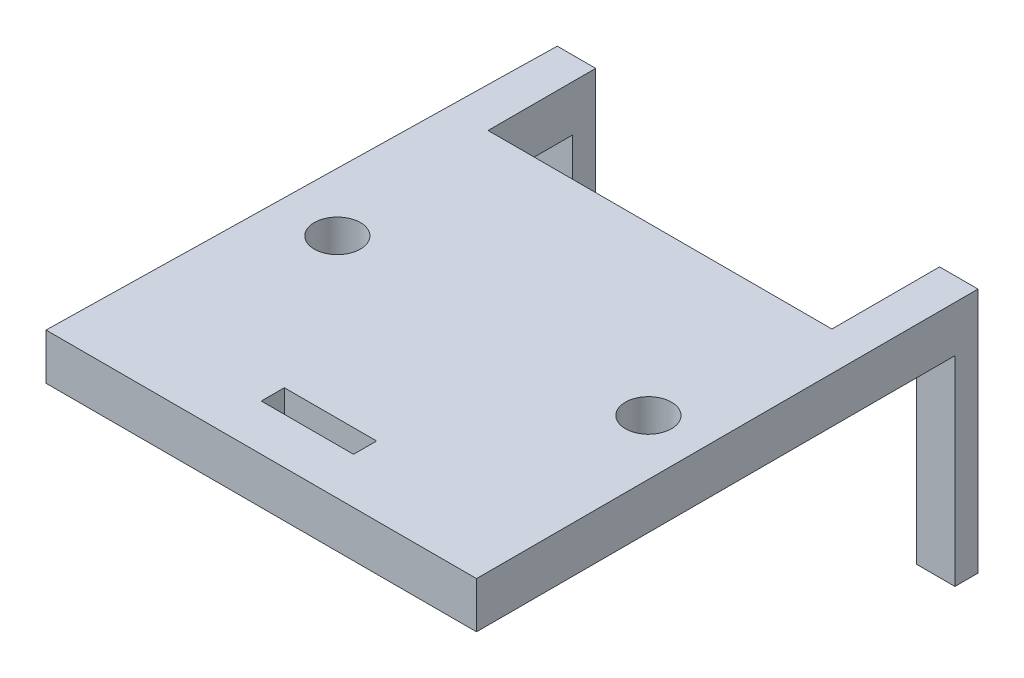
ISO-10303-21;
HEADER;
FILE_DESCRIPTION(('STEP AP214'),'2;1');
FILE_NAME('part.step','',(''),(''),'','','');
FILE_SCHEMA(('AUTOMOTIVE_DESIGN { 1 0 10303 214 1 1 1 1 }'));
ENDSEC;
DATA;
#1=APPLICATION_CONTEXT('core data for automotive mechanical design processes');
#2=APPLICATION_PROTOCOL_DEFINITION('international standard','automotive_design',2000,#1);
#3=PRODUCT_CONTEXT('',#1,'mechanical');
#4=PRODUCT('Part','Part','',(#3));
#5=PRODUCT_RELATED_PRODUCT_CATEGORY('part','',(#4));
#6=PRODUCT_DEFINITION_FORMATION('','',#4);
#7=PRODUCT_DEFINITION_CONTEXT('part definition',#1,'design');
#8=PRODUCT_DEFINITION('design','',#6,#7);
#9=PRODUCT_DEFINITION_SHAPE('','',#8);
#10=(LENGTH_UNIT() NAMED_UNIT(*) SI_UNIT(.MILLI.,.METRE.));
#11=(NAMED_UNIT(*) PLANE_ANGLE_UNIT() SI_UNIT($,.RADIAN.));
#12=(NAMED_UNIT(*) SI_UNIT($,.STERADIAN.) SOLID_ANGLE_UNIT());
#13=UNCERTAINTY_MEASURE_WITH_UNIT(LENGTH_MEASURE(1.E-05),#10,'distance_accuracy_value','');
#14=(GEOMETRIC_REPRESENTATION_CONTEXT(3) GLOBAL_UNCERTAINTY_ASSIGNED_CONTEXT((#13)) GLOBAL_UNIT_ASSIGNED_CONTEXT((#10,
#11,#12)) REPRESENTATION_CONTEXT('',''));
#15=CARTESIAN_POINT('',(0.,0.,0.));
#16=DIRECTION('',(0.,0.,1.));
#17=DIRECTION('',(1.,0.,0.));
#18=AXIS2_PLACEMENT_3D('',#15,#16,#17);
#19=CARTESIAN_POINT('',(0.,0.,0.));
#20=DIRECTION('',(0.,-1.,0.));
#21=DIRECTION('',(0.,0.,-1.));
#22=AXIS2_PLACEMENT_3D('',#19,#20,#21);
#23=PLANE('',#22);
#24=DIRECTION('',(0.,0.,-1.));
#25=VECTOR('',#24,1.);
#26=CARTESIAN_POINT('',(10.4999995670526,0.,0.));
#27=LINE('',#26,#25);
#28=CARTESIAN_POINT('',(10.4999995670526,0.,22.6135928485787));
#29=VERTEX_POINT('',#28);
#30=CARTESIAN_POINT('',(10.4999995670526,0.,21.1135928485787));
#31=VERTEX_POINT('',#30);
#32=EDGE_CURVE('E196',#29,#31,#27,.T.);
#33=ORIENTED_EDGE('',*,*,#32,.F.);
#34=DIRECTION('',(-1.,0.,0.));
#35=VECTOR('',#34,1.);
#36=CARTESIAN_POINT('',(0.,0.,22.6135928485787));
#37=LINE('',#36,#35);
#38=CARTESIAN_POINT('',(16.4999995670526,0.,22.6135928485787));
#39=VERTEX_POINT('',#38);
#40=EDGE_CURVE('E184',#39,#29,#37,.T.);
#41=ORIENTED_EDGE('',*,*,#40,.F.);
#42=DIRECTION('',(0.,0.,1.));
#43=VECTOR('',#42,1.);
#44=CARTESIAN_POINT('',(16.4999995670527,0.,0.));
#45=LINE('',#44,#43);
#46=CARTESIAN_POINT('',(16.4999995670526,0.,21.1135928485787));
#47=VERTEX_POINT('',#46);
#48=EDGE_CURVE('E159',#47,#39,#45,.T.);
#49=ORIENTED_EDGE('',*,*,#48,.F.);
#50=DIRECTION('',(1.,0.,0.));
#51=VECTOR('',#50,1.);
#52=CARTESIAN_POINT('',(0.,0.,21.1135928485787));
#53=LINE('',#52,#51);
#54=EDGE_CURVE('E193',#31,#47,#53,.T.);
#55=ORIENTED_EDGE('',*,*,#54,.F.);
#56=EDGE_LOOP('',(#33,#41,#49,#55));
#57=FACE_BOUND('',#56,.T.);
#58=CARTESIAN_POINT('',(3.66912853310911,0.,10.8361451033341));
#59=DIRECTION('',(0.,-1.,0.));
#60=DIRECTION('',(0.,0.,-1.));
#61=AXIS2_PLACEMENT_3D('',#58,#59,#60);
#62=CIRCLE('',#61,1.5);
#63=CARTESIAN_POINT('',(3.66912853310911,0.,9.33614510333406));
#64=VERTEX_POINT('',#63);
#65=EDGE_CURVE('E211',#64,#64,#62,.T.);
#66=ORIENTED_EDGE('',*,*,#65,.F.);
#67=EDGE_LOOP('',(#66));
#68=FACE_BOUND('',#67,.T.);
#69=CARTESIAN_POINT('',(23.9026242675036,0.,10.8361451033341));
#70=DIRECTION('',(0.,-1.,0.));
#71=DIRECTION('',(0.,0.,-1.));
#72=AXIS2_PLACEMENT_3D('',#69,#70,#71);
#73=CIRCLE('',#72,1.5);
#74=CARTESIAN_POINT('',(23.9026242675036,0.,9.33614510333406));
#75=VERTEX_POINT('',#74);
#76=EDGE_CURVE('E204',#75,#75,#73,.T.);
#77=ORIENTED_EDGE('',*,*,#76,.F.);
#78=EDGE_LOOP('',(#77));
#79=FACE_BOUND('',#78,.T.);
#80=DIRECTION('',(0.,0.,1.));
#81=VECTOR('',#80,1.);
#82=CARTESIAN_POINT('',(24.9999995670526,0.,-6.99866665142131));
#83=LINE('',#82,#81);
#84=CARTESIAN_POINT('',(24.9999995670526,0.,-5.49866665142131));
#85=VERTEX_POINT('',#84);
#86=CARTESIAN_POINT('',(24.9999995670526,0.,0.00133334857869202));
#87=VERTEX_POINT('',#86);
#88=EDGE_CURVE('E304',#85,#87,#83,.T.);
#89=ORIENTED_EDGE('',*,*,#88,.F.);
#90=DIRECTION('',(-1.,0.,0.));
#91=VECTOR('',#90,1.);
#92=CARTESIAN_POINT('',(24.9999995670526,0.,-5.49866665142131));
#93=LINE('',#92,#91);
#94=CARTESIAN_POINT('',(27.4999995670526,0.,-5.49866665142131));
#95=VERTEX_POINT('',#94);
#96=EDGE_CURVE('E215',#95,#85,#93,.T.);
#97=ORIENTED_EDGE('',*,*,#96,.F.);
#98=DIRECTION('',(0.,0.,-1.));
#99=VECTOR('',#98,1.);
#100=CARTESIAN_POINT('',(27.4999995670526,0.,-6.99866665142131));
#101=LINE('',#100,#99);
#102=CARTESIAN_POINT('',(27.4999995670526,0.,25.6135928485787));
#103=VERTEX_POINT('',#102);
#104=EDGE_CURVE('E300',#103,#95,#101,.T.);
#105=ORIENTED_EDGE('',*,*,#104,.F.);
#106=DIRECTION('',(1.,0.,0.));
#107=VECTOR('',#106,1.);
#108=CARTESIAN_POINT('',(27.4999995670526,0.,25.6135928485787));
#109=LINE('',#108,#107);
#110=CARTESIAN_POINT('',(-0.500000432947365,0.,25.6135928485787));
#111=VERTEX_POINT('',#110);
#112=EDGE_CURVE('E296',#111,#103,#109,.T.);
#113=ORIENTED_EDGE('',*,*,#112,.F.);
#114=DIRECTION('',(-0.0195171835765495,0.,0.999809521631615));
#115=VECTOR('',#114,1.);
#116=CARTESIAN_POINT('',(-0.500000432947365,0.,25.6135928485787));
#117=LINE('',#116,#115);
#118=CARTESIAN_POINT('',(0.107338932206711,0.,-5.49866665142131));
#119=VERTEX_POINT('',#118);
#120=EDGE_CURVE('E267',#119,#111,#117,.T.);
#121=ORIENTED_EDGE('',*,*,#120,.F.);
#122=DIRECTION('',(-1.,0.,0.));
#123=VECTOR('',#122,1.);
#124=CARTESIAN_POINT('',(0.107338932206711,0.,-5.49866665142131));
#125=LINE('',#124,#123);
#126=CARTESIAN_POINT('',(2.63662028503585,0.,-5.49866665142131));
#127=VERTEX_POINT('',#126);
#128=EDGE_CURVE('E240',#127,#119,#125,.T.);
#129=ORIENTED_EDGE('',*,*,#128,.F.);
#130=DIRECTION('',(0.,0.,-1.));
#131=VECTOR('',#130,1.);
#132=CARTESIAN_POINT('',(2.63662028503585,0.,-6.99866665142131));
#133=LINE('',#132,#131);
#134=CARTESIAN_POINT('',(2.63662028503585,0.,0.00133334857869202));
#135=VERTEX_POINT('',#134);
#136=EDGE_CURVE('E272',#135,#127,#133,.T.);
#137=ORIENTED_EDGE('',*,*,#136,.F.);
#138=DIRECTION('',(-1.,0.,0.));
#139=VECTOR('',#138,1.);
#140=CARTESIAN_POINT('',(2.63662028503585,0.,0.00133334857869202));
#141=LINE('',#140,#139);
#142=EDGE_CURVE('E307',#87,#135,#141,.T.);
#143=ORIENTED_EDGE('',*,*,#142,.F.);
#144=EDGE_LOOP('',(#89,#97,#105,#113,#121,#129,#137,#143));
#145=FACE_BOUND('',#144,.T.);
#146=ADVANCED_FACE('F39',(#57,#68,#79,#145),#23,.T.);
#147=CARTESIAN_POINT('',(-0.500000432947365,3.,25.6135928485787));
#148=DIRECTION('',(0.999809521631615,0.,0.0195171835765495));
#149=DIRECTION('',(0.0195171835765495,0.,-0.999809521631615));
#150=AXIS2_PLACEMENT_3D('',#147,#148,#149);
#151=PLANE('',#150);
#152=DIRECTION('',(0.,-1.,0.));
#153=VECTOR('',#152,1.);
#154=CARTESIAN_POINT('',(0.136620285035847,3.,-6.99866665142131));
#155=LINE('',#154,#153);
#156=CARTESIAN_POINT('',(0.136620285035847,3.,-6.99866665142131));
#157=VERTEX_POINT('',#156);
#158=CARTESIAN_POINT('',(0.136620285035847,-13.,-6.99866665142131));
#159=VERTEX_POINT('',#158);
#160=EDGE_CURVE('E293',#157,#159,#155,.T.);
#161=ORIENTED_EDGE('',*,*,#160,.T.);
#162=DIRECTION('',(0.0195171835765495,0.,-0.999809521631615));
#163=VECTOR('',#162,1.);
#164=CARTESIAN_POINT('',(0.136620285035847,-13.,-6.99866665142131));
#165=LINE('',#164,#163);
#166=CARTESIAN_POINT('',(0.107338932206711,-13.,-5.49866665142131));
#167=VERTEX_POINT('',#166);
#168=EDGE_CURVE('E248',#167,#159,#165,.T.);
#169=ORIENTED_EDGE('',*,*,#168,.F.);
#170=DIRECTION('',(0.,1.,0.));
#171=VECTOR('',#170,1.);
#172=CARTESIAN_POINT('',(0.107338932206711,-13.,-5.49866665142131));
#173=LINE('',#172,#171);
#174=EDGE_CURVE('E256',#167,#119,#173,.T.);
#175=ORIENTED_EDGE('',*,*,#174,.T.);
#176=ORIENTED_EDGE('',*,*,#120,.T.);
#177=DIRECTION('',(0.,-1.,0.));
#178=VECTOR('',#177,1.);
#179=CARTESIAN_POINT('',(-0.500000432947365,3.,25.6135928485787));
#180=LINE('',#179,#178);
#181=CARTESIAN_POINT('',(-0.500000432947365,3.,25.6135928485787));
#182=VERTEX_POINT('',#181);
#183=EDGE_CURVE('E11',#182,#111,#180,.T.);
#184=ORIENTED_EDGE('',*,*,#183,.F.);
#185=DIRECTION('',(-0.0195171835765495,0.,0.999809521631615));
#186=VECTOR('',#185,1.);
#187=CARTESIAN_POINT('',(0.,3.,0.));
#188=LINE('',#187,#186);
#189=EDGE_CURVE('E268',#157,#182,#188,.T.);
#190=ORIENTED_EDGE('',*,*,#189,.F.);
#191=EDGE_LOOP('',(#161,#169,#175,#176,#184,#190));
#192=FACE_BOUND('',#191,.T.);
#193=ADVANCED_FACE('F41',(#192),#151,.F.);
#194=CARTESIAN_POINT('',(27.4999995670526,3.,25.6135928485787));
#195=DIRECTION('',(0.,0.,-1.));
#196=DIRECTION('',(-1.,0.,0.));
#197=AXIS2_PLACEMENT_3D('',#194,#195,#196);
#198=PLANE('',#197);
#199=ORIENTED_EDGE('',*,*,#112,.T.);
#200=DIRECTION('',(0.,-1.,0.));
#201=VECTOR('',#200,1.);
#202=CARTESIAN_POINT('',(27.4999995670526,3.,25.6135928485787));
#203=LINE('',#202,#201);
#204=CARTESIAN_POINT('',(27.4999995670526,3.,25.6135928485787));
#205=VERTEX_POINT('',#204);
#206=EDGE_CURVE('E48',#205,#103,#203,.T.);
#207=ORIENTED_EDGE('',*,*,#206,.F.);
#208=DIRECTION('',(1.,0.,0.));
#209=VECTOR('',#208,1.);
#210=CARTESIAN_POINT('',(27.4999995670526,3.,25.6135928485787));
#211=LINE('',#210,#209);
#212=EDGE_CURVE('E271',#182,#205,#211,.T.);
#213=ORIENTED_EDGE('',*,*,#212,.F.);
#214=ORIENTED_EDGE('',*,*,#183,.T.);
#215=EDGE_LOOP('',(#199,#207,#213,#214));
#216=FACE_BOUND('',#215,.T.);
#217=ADVANCED_FACE('F341',(#216),#198,.F.);
#218=CARTESIAN_POINT('',(27.4999995670526,3.,-6.99866665142131));
#219=DIRECTION('',(-1.,0.,0.));
#220=DIRECTION('',(0.,0.,1.));
#221=AXIS2_PLACEMENT_3D('',#218,#219,#220);
#222=PLANE('',#221);
#223=ORIENTED_EDGE('',*,*,#104,.T.);
#224=DIRECTION('',(0.,1.,0.));
#225=VECTOR('',#224,1.);
#226=CARTESIAN_POINT('',(27.4999995670526,-13.,-5.49866665142131));
#227=LINE('',#226,#225);
#228=CARTESIAN_POINT('',(27.4999995670526,-13.,-5.49866665142131));
#229=VERTEX_POINT('',#228);
#230=EDGE_CURVE('E237',#229,#95,#227,.T.);
#231=ORIENTED_EDGE('',*,*,#230,.F.);
#232=DIRECTION('',(0.,0.,1.));
#233=VECTOR('',#232,1.);
#234=CARTESIAN_POINT('',(27.4999995670526,-13.,-5.49866665142131));
#235=LINE('',#234,#233);
#236=CARTESIAN_POINT('',(27.4999995670526,-13.,-6.99866665142131));
#237=VERTEX_POINT('',#236);
#238=EDGE_CURVE('E216',#237,#229,#235,.T.);
#239=ORIENTED_EDGE('',*,*,#238,.F.);
#240=DIRECTION('',(0.,-1.,0.));
#241=VECTOR('',#240,1.);
#242=CARTESIAN_POINT('',(27.4999995670526,3.,-6.99866665142131));
#243=LINE('',#242,#241);
#244=CARTESIAN_POINT('',(27.4999995670526,3.,-6.99866665142131));
#245=VERTEX_POINT('',#244);
#246=EDGE_CURVE('E329',#245,#237,#243,.T.);
#247=ORIENTED_EDGE('',*,*,#246,.F.);
#248=DIRECTION('',(0.,0.,-1.));
#249=VECTOR('',#248,1.);
#250=CARTESIAN_POINT('',(27.4999995670526,3.,-0.00487976486391656));
#251=LINE('',#250,#249);
#252=EDGE_CURVE('E275',#205,#245,#251,.T.);
#253=ORIENTED_EDGE('',*,*,#252,.F.);
#254=ORIENTED_EDGE('',*,*,#206,.T.);
#255=EDGE_LOOP('',(#223,#231,#239,#247,#253,#254));
#256=FACE_BOUND('',#255,.T.);
#257=ADVANCED_FACE('F336',(#256),#222,.F.);
#258=CARTESIAN_POINT('',(27.4999995670526,3.,-6.99866665142131));
#259=DIRECTION('',(0.,0.,1.));
#260=DIRECTION('',(1.,0.,0.));
#261=AXIS2_PLACEMENT_3D('',#258,#259,#260);
#262=PLANE('',#261);
#263=ORIENTED_EDGE('',*,*,#246,.T.);
#264=DIRECTION('',(1.,0.,0.));
#265=VECTOR('',#264,1.);
#266=CARTESIAN_POINT('',(27.4999995670526,-13.,-6.99866665142131));
#267=LINE('',#266,#265);
#268=CARTESIAN_POINT('',(24.9999995670526,-13.,-6.99866665142131));
#269=VERTEX_POINT('',#268);
#270=EDGE_CURVE('E227',#269,#237,#267,.T.);
#271=ORIENTED_EDGE('',*,*,#270,.F.);
#272=DIRECTION('',(0.,-1.,0.));
#273=VECTOR('',#272,1.);
#274=CARTESIAN_POINT('',(24.9999995670526,3.,-6.99866665142131));
#275=LINE('',#274,#273);
#276=CARTESIAN_POINT('',(24.9999995670526,3.,-6.99866665142131));
#277=VERTEX_POINT('',#276);
#278=EDGE_CURVE('E326',#277,#269,#275,.T.);
#279=ORIENTED_EDGE('',*,*,#278,.F.);
#280=DIRECTION('',(-1.,0.,0.));
#281=VECTOR('',#280,1.);
#282=CARTESIAN_POINT('',(27.4999995670526,3.,-6.99866665142131));
#283=LINE('',#282,#281);
#284=EDGE_CURVE('E278',#245,#277,#283,.T.);
#285=ORIENTED_EDGE('',*,*,#284,.F.);
#286=EDGE_LOOP('',(#263,#271,#279,#285));
#287=FACE_BOUND('',#286,.T.);
#288=ADVANCED_FACE('F362',(#287),#262,.F.);
#289=CARTESIAN_POINT('',(24.9999995670526,3.,-6.99866665142131));
#290=DIRECTION('',(1.,0.,0.));
#291=DIRECTION('',(0.,0.,-1.));
#292=AXIS2_PLACEMENT_3D('',#289,#290,#291);
#293=PLANE('',#292);
#294=ORIENTED_EDGE('',*,*,#278,.T.);
#295=DIRECTION('',(0.,0.,-1.));
#296=VECTOR('',#295,1.);
#297=CARTESIAN_POINT('',(24.9999995670526,-13.,-6.99866665142131));
#298=LINE('',#297,#296);
#299=CARTESIAN_POINT('',(24.9999995670526,-13.,-5.49866665142131));
#300=VERTEX_POINT('',#299);
#301=EDGE_CURVE('E223',#300,#269,#298,.T.);
#302=ORIENTED_EDGE('',*,*,#301,.F.);
#303=DIRECTION('',(0.,1.,0.));
#304=VECTOR('',#303,1.);
#305=CARTESIAN_POINT('',(24.9999995670526,-13.,-5.49866665142131));
#306=LINE('',#305,#304);
#307=EDGE_CURVE('E231',#300,#85,#306,.T.);
#308=ORIENTED_EDGE('',*,*,#307,.T.);
#309=ORIENTED_EDGE('',*,*,#88,.T.);
#310=DIRECTION('',(0.,-1.,0.));
#311=VECTOR('',#310,1.);
#312=CARTESIAN_POINT('',(24.9999995670526,3.,0.00133334857869202));
#313=LINE('',#312,#311);
#314=CARTESIAN_POINT('',(24.9999995670526,3.,0.00133334857869202));
#315=VERTEX_POINT('',#314);
#316=EDGE_CURVE('E322',#315,#87,#313,.T.);
#317=ORIENTED_EDGE('',*,*,#316,.F.);
#318=DIRECTION('',(0.,0.,1.));
#319=VECTOR('',#318,1.);
#320=CARTESIAN_POINT('',(24.9999995670526,3.,-6.99866665142131));
#321=LINE('',#320,#319);
#322=EDGE_CURVE('E281',#277,#315,#321,.T.);
#323=ORIENTED_EDGE('',*,*,#322,.F.);
#324=EDGE_LOOP('',(#294,#302,#308,#309,#317,#323));
#325=FACE_BOUND('',#324,.T.);
#326=ADVANCED_FACE('F353',(#325),#293,.F.);
#327=CARTESIAN_POINT('',(2.63662028503585,3.,0.00133334857869202));
#328=DIRECTION('',(0.,0.,1.));
#329=DIRECTION('',(1.,0.,0.));
#330=AXIS2_PLACEMENT_3D('',#327,#328,#329);
#331=PLANE('',#330);
#332=ORIENTED_EDGE('',*,*,#142,.T.);
#333=DIRECTION('',(0.,-1.,0.));
#334=VECTOR('',#333,1.);
#335=CARTESIAN_POINT('',(2.63662028503585,3.,0.00133334857869202));
#336=LINE('',#335,#334);
#337=CARTESIAN_POINT('',(2.63662028503585,3.,0.00133334857869202));
#338=VERTEX_POINT('',#337);
#339=EDGE_CURVE('E318',#338,#135,#336,.T.);
#340=ORIENTED_EDGE('',*,*,#339,.F.);
#341=DIRECTION('',(-1.,0.,0.));
#342=VECTOR('',#341,1.);
#343=CARTESIAN_POINT('',(2.63662028503585,3.,0.00133334857869202));
#344=LINE('',#343,#342);
#345=EDGE_CURVE('E284',#315,#338,#344,.T.);
#346=ORIENTED_EDGE('',*,*,#345,.F.);
#347=ORIENTED_EDGE('',*,*,#316,.T.);
#348=EDGE_LOOP('',(#332,#340,#346,#347));
#349=FACE_BOUND('',#348,.T.);
#350=ADVANCED_FACE('F383',(#349),#331,.F.);
#351=CARTESIAN_POINT('',(2.63662028503585,3.,-6.99866665142131));
#352=DIRECTION('',(-1.,0.,0.));
#353=DIRECTION('',(0.,0.,1.));
#354=AXIS2_PLACEMENT_3D('',#351,#352,#353);
#355=PLANE('',#354);
#356=ORIENTED_EDGE('',*,*,#136,.T.);
#357=DIRECTION('',(0.,1.,0.));
#358=VECTOR('',#357,1.);
#359=CARTESIAN_POINT('',(2.63662028503585,-13.,-5.49866665142131));
#360=LINE('',#359,#358);
#361=CARTESIAN_POINT('',(2.63662028503585,-13.,-5.49866665142131));
#362=VERTEX_POINT('',#361);
#363=EDGE_CURVE('E263',#362,#127,#360,.T.);
#364=ORIENTED_EDGE('',*,*,#363,.F.);
#365=DIRECTION('',(0.,0.,1.));
#366=VECTOR('',#365,1.);
#367=CARTESIAN_POINT('',(2.63662028503585,-13.,-5.49866665142131));
#368=LINE('',#367,#366);
#369=CARTESIAN_POINT('',(2.63662028503585,-13.,-6.99866665142131));
#370=VERTEX_POINT('',#369);
#371=EDGE_CURVE('E241',#370,#362,#368,.T.);
#372=ORIENTED_EDGE('',*,*,#371,.F.);
#373=DIRECTION('',(0.,-1.,0.));
#374=VECTOR('',#373,1.);
#375=CARTESIAN_POINT('',(2.63662028503585,3.,-6.99866665142131));
#376=LINE('',#375,#374);
#377=CARTESIAN_POINT('',(2.63662028503585,3.,-6.99866665142131));
#378=VERTEX_POINT('',#377);
#379=EDGE_CURVE('E315',#378,#370,#376,.T.);
#380=ORIENTED_EDGE('',*,*,#379,.F.);
#381=DIRECTION('',(0.,0.,-1.));
#382=VECTOR('',#381,1.);
#383=CARTESIAN_POINT('',(2.63662028503585,3.,-6.99866665142131));
#384=LINE('',#383,#382);
#385=EDGE_CURVE('E287',#338,#378,#384,.T.);
#386=ORIENTED_EDGE('',*,*,#385,.F.);
#387=ORIENTED_EDGE('',*,*,#339,.T.);
#388=EDGE_LOOP('',(#356,#364,#372,#380,#386,#387));
#389=FACE_BOUND('',#388,.T.);
#390=ADVANCED_FACE('F376',(#389),#355,.F.);
#391=CARTESIAN_POINT('',(0.136620285035847,3.,-6.99866665142131));
#392=DIRECTION('',(0.,0.,1.));
#393=DIRECTION('',(1.,0.,0.));
#394=AXIS2_PLACEMENT_3D('',#391,#392,#393);
#395=PLANE('',#394);
#396=ORIENTED_EDGE('',*,*,#379,.T.);
#397=DIRECTION('',(1.,0.,0.));
#398=VECTOR('',#397,1.);
#399=CARTESIAN_POINT('',(2.63662028503585,-13.,-6.99866665142131));
#400=LINE('',#399,#398);
#401=EDGE_CURVE('E252',#159,#370,#400,.T.);
#402=ORIENTED_EDGE('',*,*,#401,.F.);
#403=ORIENTED_EDGE('',*,*,#160,.F.);
#404=DIRECTION('',(-1.,0.,0.));
#405=VECTOR('',#404,1.);
#406=CARTESIAN_POINT('',(0.136620285035847,3.,-6.99866665142131));
#407=LINE('',#406,#405);
#408=EDGE_CURVE('E290',#378,#157,#407,.T.);
#409=ORIENTED_EDGE('',*,*,#408,.F.);
#410=EDGE_LOOP('',(#396,#402,#403,#409));
#411=FACE_BOUND('',#410,.T.);
#412=ADVANCED_FACE('F386',(#411),#395,.F.);
#413=CARTESIAN_POINT('',(0.,3.,0.));
#414=DIRECTION('',(0.,-1.,0.));
#415=DIRECTION('',(0.,0.,-1.));
#416=AXIS2_PLACEMENT_3D('',#413,#414,#415);
#417=PLANE('',#416);
#418=DIRECTION('',(1.,0.,0.));
#419=VECTOR('',#418,1.);
#420=CARTESIAN_POINT('',(10.4999995670526,3.,22.6135928485787));
#421=LINE('',#420,#419);
#422=CARTESIAN_POINT('',(10.4999995670526,3.,22.6135928485787));
#423=VERTEX_POINT('',#422);
#424=CARTESIAN_POINT('',(16.4999995670526,3.,22.6135928485787));
#425=VERTEX_POINT('',#424);
#426=EDGE_CURVE('E166',#423,#425,#421,.T.);
#427=ORIENTED_EDGE('',*,*,#426,.F.);
#428=DIRECTION('',(0.,0.,1.));
#429=VECTOR('',#428,1.);
#430=CARTESIAN_POINT('',(10.4999995670526,3.,21.1135928485787));
#431=LINE('',#430,#429);
#432=CARTESIAN_POINT('',(10.4999995670526,3.,21.1135928485787));
#433=VERTEX_POINT('',#432);
#434=EDGE_CURVE('E63',#433,#423,#431,.T.);
#435=ORIENTED_EDGE('',*,*,#434,.F.);
#436=DIRECTION('',(-1.,0.,0.));
#437=VECTOR('',#436,1.);
#438=CARTESIAN_POINT('',(10.4999995670526,3.,21.1135928485787));
#439=LINE('',#438,#437);
#440=CARTESIAN_POINT('',(16.4999995670526,3.,21.1135928485787));
#441=VERTEX_POINT('',#440);
#442=EDGE_CURVE('E174',#441,#433,#439,.T.);
#443=ORIENTED_EDGE('',*,*,#442,.F.);
#444=DIRECTION('',(0.,0.,-1.));
#445=VECTOR('',#444,1.);
#446=CARTESIAN_POINT('',(16.4999995670526,3.,21.1135928485787));
#447=LINE('',#446,#445);
#448=EDGE_CURVE('E156',#425,#441,#447,.T.);
#449=ORIENTED_EDGE('',*,*,#448,.F.);
#450=EDGE_LOOP('',(#427,#435,#443,#449));
#451=FACE_BOUND('',#450,.T.);
#452=CARTESIAN_POINT('',(3.66912853310911,3.,10.8361451033341));
#453=DIRECTION('',(0.,1.,0.));
#454=DIRECTION('',(0.,0.,1.));
#455=AXIS2_PLACEMENT_3D('',#452,#453,#454);
#456=CIRCLE('',#455,1.5);
#457=CARTESIAN_POINT('',(3.66912853310911,3.,12.3361451033341));
#458=VERTEX_POINT('',#457);
#459=EDGE_CURVE('E200',#458,#458,#456,.T.);
#460=ORIENTED_EDGE('',*,*,#459,.F.);
#461=EDGE_LOOP('',(#460));
#462=FACE_BOUND('',#461,.T.);
#463=CARTESIAN_POINT('',(23.9026242675036,3.,10.8361451033341));
#464=DIRECTION('',(0.,1.,0.));
#465=DIRECTION('',(0.,0.,1.));
#466=AXIS2_PLACEMENT_3D('',#463,#464,#465);
#467=CIRCLE('',#466,1.5);
#468=CARTESIAN_POINT('',(23.9026242675036,3.,12.3361451033341));
#469=VERTEX_POINT('',#468);
#470=EDGE_CURVE('E199',#469,#469,#467,.T.);
#471=ORIENTED_EDGE('',*,*,#470,.F.);
#472=EDGE_LOOP('',(#471));
#473=FACE_BOUND('',#472,.T.);
#474=ORIENTED_EDGE('',*,*,#189,.T.);
#475=ORIENTED_EDGE('',*,*,#212,.T.);
#476=ORIENTED_EDGE('',*,*,#252,.T.);
#477=ORIENTED_EDGE('',*,*,#284,.T.);
#478=ORIENTED_EDGE('',*,*,#322,.T.);
#479=ORIENTED_EDGE('',*,*,#345,.T.);
#480=ORIENTED_EDGE('',*,*,#385,.T.);
#481=ORIENTED_EDGE('',*,*,#408,.T.);
#482=EDGE_LOOP('',(#474,#475,#476,#477,#478,#479,#480,#481));
#483=FACE_BOUND('',#482,.T.);
#484=ADVANCED_FACE('F171',(#451,#462,#473,#483),#417,.F.);
#485=CARTESIAN_POINT('',(0.107338932206711,-13.,-5.49866665142131));
#486=DIRECTION('',(0.,0.,-1.));
#487=DIRECTION('',(-1.,0.,0.));
#488=AXIS2_PLACEMENT_3D('',#485,#486,#487);
#489=PLANE('',#488);
#490=ORIENTED_EDGE('',*,*,#128,.T.);
#491=ORIENTED_EDGE('',*,*,#174,.F.);
#492=DIRECTION('',(-1.,0.,0.));
#493=VECTOR('',#492,1.);
#494=CARTESIAN_POINT('',(0.107338932206711,-13.,-5.49866665142131));
#495=LINE('',#494,#493);
#496=EDGE_CURVE('E245',#362,#167,#495,.T.);
#497=ORIENTED_EDGE('',*,*,#496,.F.);
#498=ORIENTED_EDGE('',*,*,#363,.T.);
#499=EDGE_LOOP('',(#490,#491,#497,#498));
#500=FACE_BOUND('',#499,.T.);
#501=ADVANCED_FACE('F372',(#500),#489,.F.);
#502=CARTESIAN_POINT('',(0.,-13.,0.));
#503=DIRECTION('',(0.,1.,0.));
#504=DIRECTION('',(0.,0.,1.));
#505=AXIS2_PLACEMENT_3D('',#502,#503,#504);
#506=PLANE('',#505);
#507=ORIENTED_EDGE('',*,*,#371,.T.);
#508=ORIENTED_EDGE('',*,*,#496,.T.);
#509=ORIENTED_EDGE('',*,*,#168,.T.);
#510=ORIENTED_EDGE('',*,*,#401,.T.);
#511=EDGE_LOOP('',(#507,#508,#509,#510));
#512=FACE_BOUND('',#511,.T.);
#513=ADVANCED_FACE('F388',(#512),#506,.F.);
#514=CARTESIAN_POINT('',(24.9999995670526,-13.,-5.49866665142131));
#515=DIRECTION('',(0.,0.,-1.));
#516=DIRECTION('',(-1.,0.,0.));
#517=AXIS2_PLACEMENT_3D('',#514,#515,#516);
#518=PLANE('',#517);
#519=ORIENTED_EDGE('',*,*,#96,.T.);
#520=ORIENTED_EDGE('',*,*,#307,.F.);
#521=DIRECTION('',(-1.,0.,0.));
#522=VECTOR('',#521,1.);
#523=CARTESIAN_POINT('',(24.9999995670526,-13.,-5.49866665142131));
#524=LINE('',#523,#522);
#525=EDGE_CURVE('E220',#229,#300,#524,.T.);
#526=ORIENTED_EDGE('',*,*,#525,.F.);
#527=ORIENTED_EDGE('',*,*,#230,.T.);
#528=EDGE_LOOP('',(#519,#520,#526,#527));
#529=FACE_BOUND('',#528,.T.);
#530=ADVANCED_FACE('F350',(#529),#518,.F.);
#531=CARTESIAN_POINT('',(0.,-13.,0.));
#532=DIRECTION('',(0.,1.,0.));
#533=DIRECTION('',(0.,0.,1.));
#534=AXIS2_PLACEMENT_3D('',#531,#532,#533);
#535=PLANE('',#534);
#536=ORIENTED_EDGE('',*,*,#238,.T.);
#537=ORIENTED_EDGE('',*,*,#525,.T.);
#538=ORIENTED_EDGE('',*,*,#301,.T.);
#539=ORIENTED_EDGE('',*,*,#270,.T.);
#540=EDGE_LOOP('',(#536,#537,#538,#539));
#541=FACE_BOUND('',#540,.T.);
#542=ADVANCED_FACE('F359',(#541),#535,.F.);
#543=CARTESIAN_POINT('',(23.9026242675036,-7.,10.8361451033341));
#544=DIRECTION('',(0.,1.,0.));
#545=DIRECTION('',(0.,0.,1.));
#546=AXIS2_PLACEMENT_3D('',#543,#544,#545);
#547=CYLINDRICAL_SURFACE('',#546,1.5);
#548=ORIENTED_EDGE('',*,*,#76,.T.);
#549=EDGE_LOOP('',(#548));
#550=FACE_BOUND('',#549,.T.);
#551=ORIENTED_EDGE('',*,*,#470,.T.);
#552=EDGE_LOOP('',(#551));
#553=FACE_BOUND('',#552,.T.);
#554=ADVANCED_FACE('F497',(#550,#553),#547,.F.);
#555=CARTESIAN_POINT('',(3.66912853310911,-7.,10.8361451033341));
#556=DIRECTION('',(0.,1.,0.));
#557=DIRECTION('',(0.,0.,1.));
#558=AXIS2_PLACEMENT_3D('',#555,#556,#557);
#559=CYLINDRICAL_SURFACE('',#558,1.5);
#560=ORIENTED_EDGE('',*,*,#65,.T.);
#561=EDGE_LOOP('',(#560));
#562=FACE_BOUND('',#561,.T.);
#563=ORIENTED_EDGE('',*,*,#459,.T.);
#564=EDGE_LOOP('',(#563));
#565=FACE_BOUND('',#564,.T.);
#566=ADVANCED_FACE('F505',(#562,#565),#559,.F.);
#567=CARTESIAN_POINT('',(10.4999995670526,-7.,21.1135928485787));
#568=DIRECTION('',(-1.,0.,0.));
#569=DIRECTION('',(0.,0.,1.));
#570=AXIS2_PLACEMENT_3D('',#567,#568,#569);
#571=PLANE('',#570);
#572=ORIENTED_EDGE('',*,*,#32,.T.);
#573=DIRECTION('',(0.,1.,0.));
#574=VECTOR('',#573,1.);
#575=CARTESIAN_POINT('',(10.4999995670526,-7.,21.1135928485787));
#576=LINE('',#575,#574);
#577=EDGE_CURVE('E181',#31,#433,#576,.T.);
#578=ORIENTED_EDGE('',*,*,#577,.T.);
#579=ORIENTED_EDGE('',*,*,#434,.T.);
#580=DIRECTION('',(0.,1.,0.));
#581=VECTOR('',#580,1.);
#582=CARTESIAN_POINT('',(10.4999995670526,-7.,22.6135928485787));
#583=LINE('',#582,#581);
#584=EDGE_CURVE('E163',#29,#423,#583,.T.);
#585=ORIENTED_EDGE('',*,*,#584,.F.);
#586=EDGE_LOOP('',(#572,#578,#579,#585));
#587=FACE_BOUND('',#586,.T.);
#588=ADVANCED_FACE('F513',(#587),#571,.F.);
#589=CARTESIAN_POINT('',(10.4999995670526,-7.,21.1135928485787));
#590=DIRECTION('',(0.,0.,-1.));
#591=DIRECTION('',(-1.,0.,0.));
#592=AXIS2_PLACEMENT_3D('',#589,#590,#591);
#593=PLANE('',#592);
#594=ORIENTED_EDGE('',*,*,#54,.T.);
#595=DIRECTION('',(0.,1.,0.));
#596=VECTOR('',#595,1.);
#597=CARTESIAN_POINT('',(16.4999995670526,-7.,21.1135928485787));
#598=LINE('',#597,#596);
#599=EDGE_CURVE('E162',#47,#441,#598,.T.);
#600=ORIENTED_EDGE('',*,*,#599,.T.);
#601=ORIENTED_EDGE('',*,*,#442,.T.);
#602=ORIENTED_EDGE('',*,*,#577,.F.);
#603=EDGE_LOOP('',(#594,#600,#601,#602));
#604=FACE_BOUND('',#603,.T.);
#605=ADVANCED_FACE('F521',(#604),#593,.F.);
#606=CARTESIAN_POINT('',(16.4999995670526,-7.,21.1135928485787));
#607=DIRECTION('',(1.,0.,0.));
#608=DIRECTION('',(0.,0.,-1.));
#609=AXIS2_PLACEMENT_3D('',#606,#607,#608);
#610=PLANE('',#609);
#611=ORIENTED_EDGE('',*,*,#48,.T.);
#612=DIRECTION('',(0.,1.,0.));
#613=VECTOR('',#612,1.);
#614=CARTESIAN_POINT('',(16.4999995670526,-7.,22.6135928485787));
#615=LINE('',#614,#613);
#616=EDGE_CURVE('E55',#39,#425,#615,.T.);
#617=ORIENTED_EDGE('',*,*,#616,.T.);
#618=ORIENTED_EDGE('',*,*,#448,.T.);
#619=ORIENTED_EDGE('',*,*,#599,.F.);
#620=EDGE_LOOP('',(#611,#617,#618,#619));
#621=FACE_BOUND('',#620,.T.);
#622=ADVANCED_FACE('F153',(#621),#610,.F.);
#623=CARTESIAN_POINT('',(10.4999995670526,-7.,22.6135928485787));
#624=DIRECTION('',(0.,0.,1.));
#625=DIRECTION('',(1.,0.,0.));
#626=AXIS2_PLACEMENT_3D('',#623,#624,#625);
#627=PLANE('',#626);
#628=ORIENTED_EDGE('',*,*,#40,.T.);
#629=ORIENTED_EDGE('',*,*,#584,.T.);
#630=ORIENTED_EDGE('',*,*,#426,.T.);
#631=ORIENTED_EDGE('',*,*,#616,.F.);
#632=EDGE_LOOP('',(#628,#629,#630,#631));
#633=FACE_BOUND('',#632,.T.);
#634=ADVANCED_FACE('F167',(#633),#627,.F.);
#635=CLOSED_SHELL('',(#146,#193,#217,#257,#288,#326,#350,#390,#412,#484,#501,#513,#530,#542,
#554,#566,#588,#605,#622,#634));
#636=MANIFOLD_SOLID_BREP('B2',#635);
#637=ADVANCED_BREP_SHAPE_REPRESENTATION('',(#18,#636),#14);
#638=SHAPE_DEFINITION_REPRESENTATION(#9,#637);
ENDSEC;
END-ISO-10303-21;
